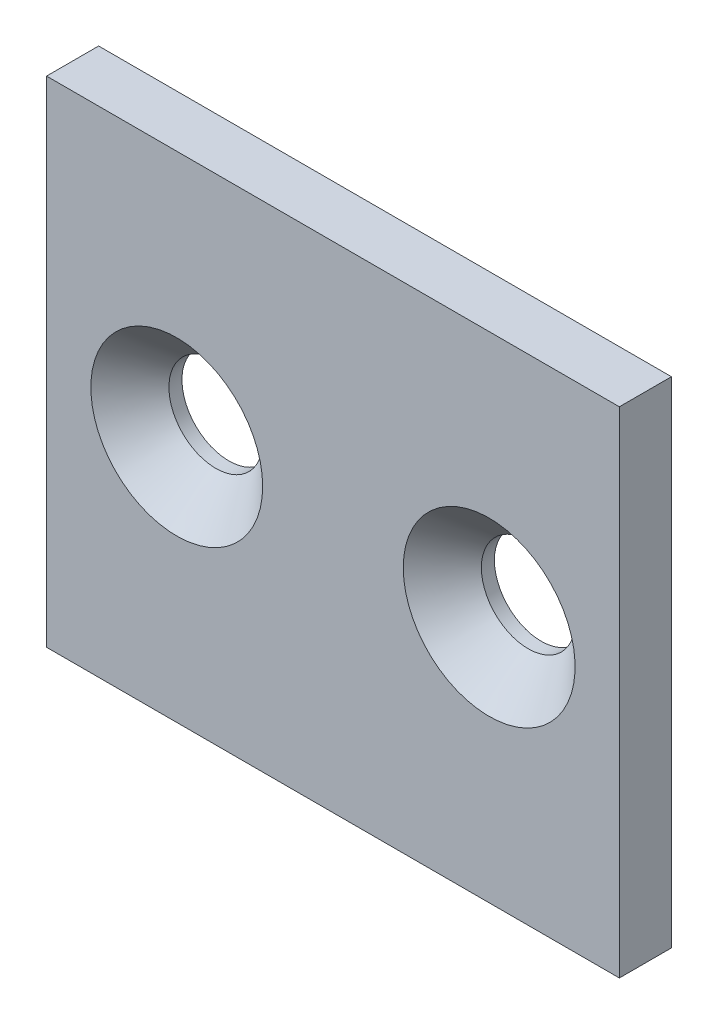
ISO-10303-21;
HEADER;
FILE_DESCRIPTION(('STEP AP214'),'2;1');
FILE_NAME('part.step','',(''),(''),'','','');
FILE_SCHEMA(('AUTOMOTIVE_DESIGN { 1 0 10303 214 1 1 1 1 }'));
ENDSEC;
DATA;
#1=APPLICATION_CONTEXT('core data for automotive mechanical design processes');
#2=APPLICATION_PROTOCOL_DEFINITION('international standard','automotive_design',2000,#1);
#3=PRODUCT_CONTEXT('',#1,'mechanical');
#4=PRODUCT('Part','Part','',(#3));
#5=PRODUCT_RELATED_PRODUCT_CATEGORY('part','',(#4));
#6=PRODUCT_DEFINITION_FORMATION('','',#4);
#7=PRODUCT_DEFINITION_CONTEXT('part definition',#1,'design');
#8=PRODUCT_DEFINITION('design','',#6,#7);
#9=PRODUCT_DEFINITION_SHAPE('','',#8);
#10=(LENGTH_UNIT() NAMED_UNIT(*) SI_UNIT(.MILLI.,.METRE.));
#11=(NAMED_UNIT(*) PLANE_ANGLE_UNIT() SI_UNIT($,.RADIAN.));
#12=(NAMED_UNIT(*) SI_UNIT($,.STERADIAN.) SOLID_ANGLE_UNIT());
#13=UNCERTAINTY_MEASURE_WITH_UNIT(LENGTH_MEASURE(1.E-05),#10,'distance_accuracy_value','');
#14=(GEOMETRIC_REPRESENTATION_CONTEXT(3) GLOBAL_UNCERTAINTY_ASSIGNED_CONTEXT((#13)) GLOBAL_UNIT_ASSIGNED_CONTEXT((#10,
#11,#12)) REPRESENTATION_CONTEXT('',''));
#15=CARTESIAN_POINT('',(0.,0.,0.));
#16=DIRECTION('',(0.,0.,1.));
#17=DIRECTION('',(1.,0.,0.));
#18=AXIS2_PLACEMENT_3D('',#15,#16,#17);
#19=CARTESIAN_POINT('',(0.,0.,2.));
#20=DIRECTION('',(0.,0.,-1.));
#21=DIRECTION('',(-1.,0.,0.));
#22=AXIS2_PLACEMENT_3D('',#19,#20,#21);
#23=PLANE('',#22);
#24=CARTESIAN_POINT('',(-6.,0.,2.));
#25=DIRECTION('',(0.,0.,1.));
#26=DIRECTION('',(1.,0.,0.));
#27=AXIS2_PLACEMENT_3D('',#24,#25,#26);
#28=CIRCLE('',#27,3.3);
#29=CARTESIAN_POINT('',(-2.7,0.,2.));
#30=VERTEX_POINT('',#29);
#31=EDGE_CURVE('E84',#30,#30,#28,.T.);
#32=ORIENTED_EDGE('',*,*,#31,.F.);
#33=EDGE_LOOP('',(#32));
#34=FACE_BOUND('',#33,.T.);
#35=DIRECTION('',(0.,-1.,0.));
#36=VECTOR('',#35,1.);
#37=CARTESIAN_POINT('',(-11.,9.49999999999999,2.));
#38=LINE('',#37,#36);
#39=CARTESIAN_POINT('',(-11.,9.49999999999999,2.));
#40=VERTEX_POINT('',#39);
#41=CARTESIAN_POINT('',(-11.,-9.49999999999999,2.));
#42=VERTEX_POINT('',#41);
#43=EDGE_CURVE('E69',#40,#42,#38,.T.);
#44=ORIENTED_EDGE('',*,*,#43,.T.);
#45=DIRECTION('',(1.,0.,0.));
#46=VECTOR('',#45,1.);
#47=CARTESIAN_POINT('',(11.,-9.49999999999999,2.));
#48=LINE('',#47,#46);
#49=CARTESIAN_POINT('',(11.,-9.49999999999999,2.));
#50=VERTEX_POINT('',#49);
#51=EDGE_CURVE('E64',#42,#50,#48,.T.);
#52=ORIENTED_EDGE('',*,*,#51,.T.);
#53=DIRECTION('',(0.,1.,0.));
#54=VECTOR('',#53,1.);
#55=CARTESIAN_POINT('',(11.,9.5,2.));
#56=LINE('',#55,#54);
#57=CARTESIAN_POINT('',(11.,9.5,2.));
#58=VERTEX_POINT('',#57);
#59=EDGE_CURVE('E67',#50,#58,#56,.T.);
#60=ORIENTED_EDGE('',*,*,#59,.T.);
#61=DIRECTION('',(-1.,0.,0.));
#62=VECTOR('',#61,1.);
#63=CARTESIAN_POINT('',(11.,9.5,2.));
#64=LINE('',#63,#62);
#65=EDGE_CURVE('E34',#58,#40,#64,.T.);
#66=ORIENTED_EDGE('',*,*,#65,.T.);
#67=EDGE_LOOP('',(#44,#52,#60,#66));
#68=FACE_BOUND('',#67,.T.);
#69=CARTESIAN_POINT('',(6.,0.,2.));
#70=DIRECTION('',(0.,0.,-1.));
#71=DIRECTION('',(-1.,0.,0.));
#72=AXIS2_PLACEMENT_3D('',#69,#70,#71);
#73=CIRCLE('',#72,3.3);
#74=CARTESIAN_POINT('',(2.7,0.,2.));
#75=VERTEX_POINT('',#74);
#76=EDGE_CURVE('E104',#75,#75,#73,.T.);
#77=ORIENTED_EDGE('',*,*,#76,.T.);
#78=EDGE_LOOP('',(#77));
#79=FACE_BOUND('',#78,.T.);
#80=ADVANCED_FACE('F17',(#34,#68,#79),#23,.F.);
#81=CARTESIAN_POINT('',(0.,0.,0.));
#82=DIRECTION('',(0.,0.,-1.));
#83=DIRECTION('',(-1.,0.,0.));
#84=AXIS2_PLACEMENT_3D('',#81,#82,#83);
#85=PLANE('',#84);
#86=CARTESIAN_POINT('',(-6.,0.,0.));
#87=DIRECTION('',(0.,0.,1.));
#88=DIRECTION('',(1.,0.,0.));
#89=AXIS2_PLACEMENT_3D('',#86,#87,#88);
#90=CIRCLE('',#89,1.8);
#91=CARTESIAN_POINT('',(-4.2,0.,0.));
#92=VERTEX_POINT('',#91);
#93=EDGE_CURVE('E101',#92,#92,#90,.T.);
#94=ORIENTED_EDGE('',*,*,#93,.T.);
#95=EDGE_LOOP('',(#94));
#96=FACE_BOUND('',#95,.T.);
#97=DIRECTION('',(0.,-1.,0.));
#98=VECTOR('',#97,1.);
#99=CARTESIAN_POINT('',(-11.,9.49999999999999,0.));
#100=LINE('',#99,#98);
#101=CARTESIAN_POINT('',(-11.,9.49999999999999,0.));
#102=VERTEX_POINT('',#101);
#103=CARTESIAN_POINT('',(-11.,-9.49999999999999,0.));
#104=VERTEX_POINT('',#103);
#105=EDGE_CURVE('E81',#102,#104,#100,.T.);
#106=ORIENTED_EDGE('',*,*,#105,.F.);
#107=DIRECTION('',(-1.,0.,0.));
#108=VECTOR('',#107,1.);
#109=CARTESIAN_POINT('',(11.,9.5,0.));
#110=LINE('',#109,#108);
#111=CARTESIAN_POINT('',(11.,9.5,0.));
#112=VERTEX_POINT('',#111);
#113=EDGE_CURVE('E57',#112,#102,#110,.T.);
#114=ORIENTED_EDGE('',*,*,#113,.F.);
#115=DIRECTION('',(0.,1.,0.));
#116=VECTOR('',#115,1.);
#117=CARTESIAN_POINT('',(11.,9.5,0.));
#118=LINE('',#117,#116);
#119=CARTESIAN_POINT('',(11.,-9.49999999999999,0.));
#120=VERTEX_POINT('',#119);
#121=EDGE_CURVE('E51',#120,#112,#118,.T.);
#122=ORIENTED_EDGE('',*,*,#121,.F.);
#123=DIRECTION('',(1.,0.,0.));
#124=VECTOR('',#123,1.);
#125=CARTESIAN_POINT('',(11.,-9.49999999999999,0.));
#126=LINE('',#125,#124);
#127=EDGE_CURVE('E73',#104,#120,#126,.T.);
#128=ORIENTED_EDGE('',*,*,#127,.F.);
#129=EDGE_LOOP('',(#106,#114,#122,#128));
#130=FACE_BOUND('',#129,.T.);
#131=CARTESIAN_POINT('',(6.,0.,0.));
#132=DIRECTION('',(0.,0.,-1.));
#133=DIRECTION('',(-1.,0.,0.));
#134=AXIS2_PLACEMENT_3D('',#131,#132,#133);
#135=CIRCLE('',#134,1.8);
#136=CARTESIAN_POINT('',(4.2,0.,0.));
#137=VERTEX_POINT('',#136);
#138=EDGE_CURVE('E110',#137,#137,#135,.T.);
#139=ORIENTED_EDGE('',*,*,#138,.F.);
#140=EDGE_LOOP('',(#139));
#141=FACE_BOUND('',#140,.T.);
#142=ADVANCED_FACE('F92',(#96,#130,#141),#85,.T.);
#143=CARTESIAN_POINT('',(-11.,9.49999999999999,2.));
#144=DIRECTION('',(1.,0.,0.));
#145=DIRECTION('',(0.,0.,-1.));
#146=AXIS2_PLACEMENT_3D('',#143,#144,#145);
#147=PLANE('',#146);
#148=ORIENTED_EDGE('',*,*,#105,.T.);
#149=DIRECTION('',(0.,0.,-1.));
#150=VECTOR('',#149,1.);
#151=CARTESIAN_POINT('',(-11.,-9.49999999999999,2.));
#152=LINE('',#151,#150);
#153=EDGE_CURVE('E11',#42,#104,#152,.T.);
#154=ORIENTED_EDGE('',*,*,#153,.F.);
#155=ORIENTED_EDGE('',*,*,#43,.F.);
#156=DIRECTION('',(0.,0.,-1.));
#157=VECTOR('',#156,1.);
#158=CARTESIAN_POINT('',(-11.,9.49999999999999,2.));
#159=LINE('',#158,#157);
#160=EDGE_CURVE('E77',#40,#102,#159,.T.);
#161=ORIENTED_EDGE('',*,*,#160,.T.);
#162=EDGE_LOOP('',(#148,#154,#155,#161));
#163=FACE_BOUND('',#162,.T.);
#164=ADVANCED_FACE('F19',(#163),#147,.F.);
#165=CARTESIAN_POINT('',(11.,-9.49999999999999,2.));
#166=DIRECTION('',(0.,1.,0.));
#167=DIRECTION('',(-1.,0.,0.));
#168=AXIS2_PLACEMENT_3D('',#165,#166,#167);
#169=PLANE('',#168);
#170=ORIENTED_EDGE('',*,*,#127,.T.);
#171=DIRECTION('',(0.,0.,-1.));
#172=VECTOR('',#171,1.);
#173=CARTESIAN_POINT('',(11.,-9.49999999999999,2.));
#174=LINE('',#173,#172);
#175=EDGE_CURVE('E26',#50,#120,#174,.T.);
#176=ORIENTED_EDGE('',*,*,#175,.F.);
#177=ORIENTED_EDGE('',*,*,#51,.F.);
#178=ORIENTED_EDGE('',*,*,#153,.T.);
#179=EDGE_LOOP('',(#170,#176,#177,#178));
#180=FACE_BOUND('',#179,.T.);
#181=ADVANCED_FACE('F72',(#180),#169,.F.);
#182=CARTESIAN_POINT('',(11.,9.5,2.));
#183=DIRECTION('',(-1.,0.,0.));
#184=DIRECTION('',(0.,-1.,0.));
#185=AXIS2_PLACEMENT_3D('',#182,#183,#184);
#186=PLANE('',#185);
#187=ORIENTED_EDGE('',*,*,#121,.T.);
#188=DIRECTION('',(0.,0.,-1.));
#189=VECTOR('',#188,1.);
#190=CARTESIAN_POINT('',(11.,9.5,2.));
#191=LINE('',#190,#189);
#192=EDGE_CURVE('E74',#58,#112,#191,.T.);
#193=ORIENTED_EDGE('',*,*,#192,.F.);
#194=ORIENTED_EDGE('',*,*,#59,.F.);
#195=ORIENTED_EDGE('',*,*,#175,.T.);
#196=EDGE_LOOP('',(#187,#193,#194,#195));
#197=FACE_BOUND('',#196,.T.);
#198=ADVANCED_FACE('F75',(#197),#186,.F.);
#199=CARTESIAN_POINT('',(11.,9.5,2.));
#200=DIRECTION('',(0.,-1.,0.));
#201=DIRECTION('',(1.,0.,0.));
#202=AXIS2_PLACEMENT_3D('',#199,#200,#201);
#203=PLANE('',#202);
#204=ORIENTED_EDGE('',*,*,#113,.T.);
#205=ORIENTED_EDGE('',*,*,#160,.F.);
#206=ORIENTED_EDGE('',*,*,#65,.F.);
#207=ORIENTED_EDGE('',*,*,#192,.T.);
#208=EDGE_LOOP('',(#204,#205,#206,#207));
#209=FACE_BOUND('',#208,.T.);
#210=ADVANCED_FACE('F89',(#209),#203,.F.);
#211=CARTESIAN_POINT('',(-6.,0.,0.500000000000005));
#212=DIRECTION('',(0.,0.,1.));
#213=DIRECTION('',(1.,0.,0.));
#214=AXIS2_PLACEMENT_3D('',#211,#212,#213);
#215=CONICAL_SURFACE('',#214,1.8,0.78539816339745);
#216=ORIENTED_EDGE('',*,*,#31,.T.);
#217=EDGE_LOOP('',(#216));
#218=FACE_BOUND('',#217,.T.);
#219=CARTESIAN_POINT('',(-6.,0.,0.500000000000005));
#220=DIRECTION('',(0.,0.,1.));
#221=DIRECTION('',(1.,0.,0.));
#222=AXIS2_PLACEMENT_3D('',#219,#220,#221);
#223=CIRCLE('',#222,1.8);
#224=CARTESIAN_POINT('',(-4.2,0.,0.500000000000005));
#225=VERTEX_POINT('',#224);
#226=EDGE_CURVE('E98',#225,#225,#223,.T.);
#227=ORIENTED_EDGE('',*,*,#226,.F.);
#228=EDGE_LOOP('',(#227));
#229=FACE_BOUND('',#228,.T.);
#230=ADVANCED_FACE('F129',(#218,#229),#215,.F.);
#231=CARTESIAN_POINT('',(-6.,0.,2.));
#232=DIRECTION('',(0.,0.,1.));
#233=DIRECTION('',(1.,0.,0.));
#234=AXIS2_PLACEMENT_3D('',#231,#232,#233);
#235=CYLINDRICAL_SURFACE('',#234,1.8);
#236=ORIENTED_EDGE('',*,*,#226,.T.);
#237=EDGE_LOOP('',(#236));
#238=FACE_BOUND('',#237,.T.);
#239=ORIENTED_EDGE('',*,*,#93,.F.);
#240=EDGE_LOOP('',(#239));
#241=FACE_BOUND('',#240,.T.);
#242=ADVANCED_FACE('F155',(#238,#241),#235,.F.);
#243=CARTESIAN_POINT('',(6.,0.,0.500000000000005));
#244=DIRECTION('',(0.,0.,1.));
#245=DIRECTION('',(-1.,0.,0.));
#246=AXIS2_PLACEMENT_3D('',#243,#244,#245);
#247=CONICAL_SURFACE('',#246,1.8,0.78539816339745);
#248=ORIENTED_EDGE('',*,*,#76,.F.);
#249=EDGE_LOOP('',(#248));
#250=FACE_BOUND('',#249,.T.);
#251=CARTESIAN_POINT('',(6.,0.,0.500000000000005));
#252=DIRECTION('',(0.,0.,-1.));
#253=DIRECTION('',(-1.,0.,0.));
#254=AXIS2_PLACEMENT_3D('',#251,#252,#253);
#255=CIRCLE('',#254,1.8);
#256=CARTESIAN_POINT('',(4.2,0.,0.500000000000005));
#257=VERTEX_POINT('',#256);
#258=EDGE_CURVE('E107',#257,#257,#255,.T.);
#259=ORIENTED_EDGE('',*,*,#258,.T.);
#260=EDGE_LOOP('',(#259));
#261=FACE_BOUND('',#260,.T.);
#262=ADVANCED_FACE('F163',(#250,#261),#247,.F.);
#263=CARTESIAN_POINT('',(6.,0.,2.));
#264=DIRECTION('',(0.,0.,1.));
#265=DIRECTION('',(-1.,0.,0.));
#266=AXIS2_PLACEMENT_3D('',#263,#264,#265);
#267=CYLINDRICAL_SURFACE('',#266,1.8);
#268=ORIENTED_EDGE('',*,*,#258,.F.);
#269=EDGE_LOOP('',(#268));
#270=FACE_BOUND('',#269,.T.);
#271=ORIENTED_EDGE('',*,*,#138,.T.);
#272=EDGE_LOOP('',(#271));
#273=FACE_BOUND('',#272,.T.);
#274=ADVANCED_FACE('F114',(#270,#273),#267,.F.);
#275=CLOSED_SHELL('',(#80,#142,#164,#181,#198,#210,#230,#242,#262,#274));
#276=MANIFOLD_SOLID_BREP('B1',#275);
#277=ADVANCED_BREP_SHAPE_REPRESENTATION('',(#18,#276),#14);
#278=SHAPE_DEFINITION_REPRESENTATION(#9,#277);
ENDSEC;
END-ISO-10303-21;
